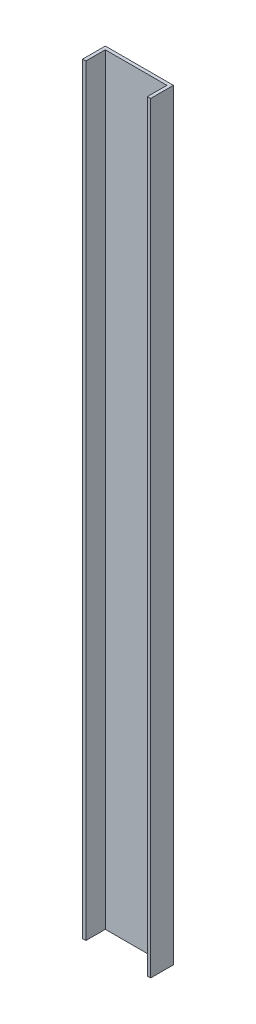
ISO-10303-21;
HEADER;
FILE_DESCRIPTION(('STEP AP214'),'2;1');
FILE_NAME('part.step','',(''),(''),'','','');
FILE_SCHEMA(('AUTOMOTIVE_DESIGN { 1 0 10303 214 1 1 1 1 }'));
ENDSEC;
DATA;
#1=APPLICATION_CONTEXT('core data for automotive mechanical design processes');
#2=APPLICATION_PROTOCOL_DEFINITION('international standard','automotive_design',2000,#1);
#3=PRODUCT_CONTEXT('',#1,'mechanical');
#4=PRODUCT('Part','Part','',(#3));
#5=PRODUCT_RELATED_PRODUCT_CATEGORY('part','',(#4));
#6=PRODUCT_DEFINITION_FORMATION('','',#4);
#7=PRODUCT_DEFINITION_CONTEXT('part definition',#1,'design');
#8=PRODUCT_DEFINITION('design','',#6,#7);
#9=PRODUCT_DEFINITION_SHAPE('','',#8);
#10=(LENGTH_UNIT() NAMED_UNIT(*) SI_UNIT(.MILLI.,.METRE.));
#11=(NAMED_UNIT(*) PLANE_ANGLE_UNIT() SI_UNIT($,.RADIAN.));
#12=(NAMED_UNIT(*) SI_UNIT($,.STERADIAN.) SOLID_ANGLE_UNIT());
#13=UNCERTAINTY_MEASURE_WITH_UNIT(LENGTH_MEASURE(1.E-05),#10,'distance_accuracy_value','');
#14=(GEOMETRIC_REPRESENTATION_CONTEXT(3) GLOBAL_UNCERTAINTY_ASSIGNED_CONTEXT((#13)) GLOBAL_UNIT_ASSIGNED_CONTEXT((#10,
#11,#12)) REPRESENTATION_CONTEXT('',''));
#15=CARTESIAN_POINT('',(0.,0.,0.));
#16=DIRECTION('',(0.,0.,1.));
#17=DIRECTION('',(1.,0.,0.));
#18=AXIS2_PLACEMENT_3D('',#15,#16,#17);
#19=CARTESIAN_POINT('',(200.,0.,-70.));
#20=DIRECTION('',(0.,0.,-1.));
#21=DIRECTION('',(-1.,0.,0.));
#22=AXIS2_PLACEMENT_3D('',#19,#20,#21);
#23=PLANE('',#22);
#24=DIRECTION('',(-1.,0.,0.));
#25=VECTOR('',#24,1.);
#26=CARTESIAN_POINT('',(200.,2350.,-70.));
#27=LINE('',#26,#25);
#28=CARTESIAN_POINT('',(200.,2350.,-70.));
#29=VERTEX_POINT('',#28);
#30=CARTESIAN_POINT('',(-10.,2350.,-70.));
#31=VERTEX_POINT('',#30);
#32=EDGE_CURVE('E130',#29,#31,#27,.T.);
#33=ORIENTED_EDGE('',*,*,#32,.F.);
#34=DIRECTION('',(0.,1.,0.));
#35=VECTOR('',#34,1.);
#36=CARTESIAN_POINT('',(200.,0.,-70.));
#37=LINE('',#36,#35);
#38=CARTESIAN_POINT('',(200.,0.,-70.));
#39=VERTEX_POINT('',#38);
#40=EDGE_CURVE('E11',#39,#29,#37,.T.);
#41=ORIENTED_EDGE('',*,*,#40,.F.);
#42=DIRECTION('',(-1.,0.,0.));
#43=VECTOR('',#42,1.);
#44=CARTESIAN_POINT('',(200.,0.,-70.));
#45=LINE('',#44,#43);
#46=CARTESIAN_POINT('',(-10.,0.,-70.));
#47=VERTEX_POINT('',#46);
#48=EDGE_CURVE('E150',#39,#47,#45,.T.);
#49=ORIENTED_EDGE('',*,*,#48,.T.);
#50=DIRECTION('',(0.,1.,0.));
#51=VECTOR('',#50,1.);
#52=CARTESIAN_POINT('',(-10.,0.,-70.));
#53=LINE('',#52,#51);
#54=EDGE_CURVE('E36',#47,#31,#53,.T.);
#55=ORIENTED_EDGE('',*,*,#54,.T.);
#56=EDGE_LOOP('',(#33,#41,#49,#55));
#57=FACE_BOUND('',#56,.T.);
#58=ADVANCED_FACE('F33',(#57),#23,.T.);
#59=CARTESIAN_POINT('',(200.,0.,0.));
#60=DIRECTION('',(1.,0.,0.));
#61=DIRECTION('',(0.,0.,-1.));
#62=AXIS2_PLACEMENT_3D('',#59,#60,#61);
#63=PLANE('',#62);
#64=DIRECTION('',(0.,0.,-1.));
#65=VECTOR('',#64,1.);
#66=CARTESIAN_POINT('',(200.,2350.,0.));
#67=LINE('',#66,#65);
#68=CARTESIAN_POINT('',(200.,2350.,0.));
#69=VERTEX_POINT('',#68);
#70=EDGE_CURVE('E148',#69,#29,#67,.T.);
#71=ORIENTED_EDGE('',*,*,#70,.F.);
#72=DIRECTION('',(0.,1.,0.));
#73=VECTOR('',#72,1.);
#74=CARTESIAN_POINT('',(200.,0.,0.));
#75=LINE('',#74,#73);
#76=CARTESIAN_POINT('',(200.,0.,0.));
#77=VERTEX_POINT('',#76);
#78=EDGE_CURVE('E42',#77,#69,#75,.T.);
#79=ORIENTED_EDGE('',*,*,#78,.F.);
#80=DIRECTION('',(0.,0.,-1.));
#81=VECTOR('',#80,1.);
#82=CARTESIAN_POINT('',(200.,0.,0.));
#83=LINE('',#82,#81);
#84=EDGE_CURVE('E120',#77,#39,#83,.T.);
#85=ORIENTED_EDGE('',*,*,#84,.T.);
#86=ORIENTED_EDGE('',*,*,#40,.T.);
#87=EDGE_LOOP('',(#71,#79,#85,#86));
#88=FACE_BOUND('',#87,.T.);
#89=ADVANCED_FACE('F162',(#88),#63,.T.);
#90=CARTESIAN_POINT('',(190.,0.,0.));
#91=DIRECTION('',(0.,0.,1.));
#92=DIRECTION('',(1.,0.,0.));
#93=AXIS2_PLACEMENT_3D('',#90,#91,#92);
#94=PLANE('',#93);
#95=DIRECTION('',(1.,0.,0.));
#96=VECTOR('',#95,1.);
#97=CARTESIAN_POINT('',(190.,2350.,0.));
#98=LINE('',#97,#96);
#99=CARTESIAN_POINT('',(190.,2350.,0.));
#100=VERTEX_POINT('',#99);
#101=EDGE_CURVE('E107',#100,#69,#98,.T.);
#102=ORIENTED_EDGE('',*,*,#101,.F.);
#103=DIRECTION('',(0.,1.,0.));
#104=VECTOR('',#103,1.);
#105=CARTESIAN_POINT('',(190.,0.,0.));
#106=LINE('',#105,#104);
#107=CARTESIAN_POINT('',(190.,0.,0.));
#108=VERTEX_POINT('',#107);
#109=EDGE_CURVE('E102',#108,#100,#106,.T.);
#110=ORIENTED_EDGE('',*,*,#109,.F.);
#111=DIRECTION('',(1.,0.,0.));
#112=VECTOR('',#111,1.);
#113=CARTESIAN_POINT('',(190.,0.,0.));
#114=LINE('',#113,#112);
#115=EDGE_CURVE('E105',#108,#77,#114,.T.);
#116=ORIENTED_EDGE('',*,*,#115,.T.);
#117=ORIENTED_EDGE('',*,*,#78,.T.);
#118=EDGE_LOOP('',(#102,#110,#116,#117));
#119=FACE_BOUND('',#118,.T.);
#120=ADVANCED_FACE('F104',(#119),#94,.T.);
#121=CARTESIAN_POINT('',(190.,0.,-60.));
#122=DIRECTION('',(-1.,0.,0.));
#123=DIRECTION('',(0.,0.,1.));
#124=AXIS2_PLACEMENT_3D('',#121,#122,#123);
#125=PLANE('',#124);
#126=DIRECTION('',(0.,0.,1.));
#127=VECTOR('',#126,1.);
#128=CARTESIAN_POINT('',(190.,2350.,-60.));
#129=LINE('',#128,#127);
#130=CARTESIAN_POINT('',(190.,2350.,-60.));
#131=VERTEX_POINT('',#130);
#132=EDGE_CURVE('E145',#131,#100,#129,.T.);
#133=ORIENTED_EDGE('',*,*,#132,.F.);
#134=DIRECTION('',(0.,1.,0.));
#135=VECTOR('',#134,1.);
#136=CARTESIAN_POINT('',(190.,0.,-60.));
#137=LINE('',#136,#135);
#138=CARTESIAN_POINT('',(190.,0.,-60.));
#139=VERTEX_POINT('',#138);
#140=EDGE_CURVE('E112',#139,#131,#137,.T.);
#141=ORIENTED_EDGE('',*,*,#140,.F.);
#142=DIRECTION('',(0.,0.,1.));
#143=VECTOR('',#142,1.);
#144=CARTESIAN_POINT('',(190.,0.,-60.));
#145=LINE('',#144,#143);
#146=EDGE_CURVE('E118',#139,#108,#145,.T.);
#147=ORIENTED_EDGE('',*,*,#146,.T.);
#148=ORIENTED_EDGE('',*,*,#109,.T.);
#149=EDGE_LOOP('',(#133,#141,#147,#148));
#150=FACE_BOUND('',#149,.T.);
#151=ADVANCED_FACE('F122',(#150),#125,.T.);
#152=CARTESIAN_POINT('',(0.,0.,-60.));
#153=DIRECTION('',(0.,0.,1.));
#154=DIRECTION('',(1.,0.,0.));
#155=AXIS2_PLACEMENT_3D('',#152,#153,#154);
#156=PLANE('',#155);
#157=DIRECTION('',(1.,0.,0.));
#158=VECTOR('',#157,1.);
#159=CARTESIAN_POINT('',(0.,2350.,-60.));
#160=LINE('',#159,#158);
#161=CARTESIAN_POINT('',(0.,2350.,-60.));
#162=VERTEX_POINT('',#161);
#163=EDGE_CURVE('E142',#162,#131,#160,.T.);
#164=ORIENTED_EDGE('',*,*,#163,.F.);
#165=DIRECTION('',(0.,1.,0.));
#166=VECTOR('',#165,1.);
#167=CARTESIAN_POINT('',(0.,0.,-60.));
#168=LINE('',#167,#166);
#169=CARTESIAN_POINT('',(0.,0.,-60.));
#170=VERTEX_POINT('',#169);
#171=EDGE_CURVE('E154',#170,#162,#168,.T.);
#172=ORIENTED_EDGE('',*,*,#171,.F.);
#173=DIRECTION('',(1.,0.,0.));
#174=VECTOR('',#173,1.);
#175=CARTESIAN_POINT('',(0.,0.,-60.));
#176=LINE('',#175,#174);
#177=EDGE_CURVE('E123',#170,#139,#176,.T.);
#178=ORIENTED_EDGE('',*,*,#177,.T.);
#179=ORIENTED_EDGE('',*,*,#140,.T.);
#180=EDGE_LOOP('',(#164,#172,#178,#179));
#181=FACE_BOUND('',#180,.T.);
#182=ADVANCED_FACE('F175',(#181),#156,.T.);
#183=CARTESIAN_POINT('',(0.,0.,0.));
#184=DIRECTION('',(1.,0.,0.));
#185=DIRECTION('',(0.,0.,-1.));
#186=AXIS2_PLACEMENT_3D('',#183,#184,#185);
#187=PLANE('',#186);
#188=DIRECTION('',(0.,0.,-1.));
#189=VECTOR('',#188,1.);
#190=CARTESIAN_POINT('',(0.,2350.,0.));
#191=LINE('',#190,#189);
#192=CARTESIAN_POINT('',(0.,2350.,0.));
#193=VERTEX_POINT('',#192);
#194=EDGE_CURVE('E139',#193,#162,#191,.T.);
#195=ORIENTED_EDGE('',*,*,#194,.F.);
#196=DIRECTION('',(0.,1.,0.));
#197=VECTOR('',#196,1.);
#198=CARTESIAN_POINT('',(0.,0.,0.));
#199=LINE('',#198,#197);
#200=CARTESIAN_POINT('',(0.,0.,0.));
#201=VERTEX_POINT('',#200);
#202=EDGE_CURVE('E156',#201,#193,#199,.T.);
#203=ORIENTED_EDGE('',*,*,#202,.F.);
#204=DIRECTION('',(0.,0.,-1.));
#205=VECTOR('',#204,1.);
#206=CARTESIAN_POINT('',(0.,0.,0.));
#207=LINE('',#206,#205);
#208=EDGE_CURVE('E125',#201,#170,#207,.T.);
#209=ORIENTED_EDGE('',*,*,#208,.T.);
#210=ORIENTED_EDGE('',*,*,#171,.T.);
#211=EDGE_LOOP('',(#195,#203,#209,#210));
#212=FACE_BOUND('',#211,.T.);
#213=ADVANCED_FACE('F178',(#212),#187,.T.);
#214=CARTESIAN_POINT('',(-10.,0.,0.));
#215=DIRECTION('',(0.,0.,1.));
#216=DIRECTION('',(1.,0.,0.));
#217=AXIS2_PLACEMENT_3D('',#214,#215,#216);
#218=PLANE('',#217);
#219=DIRECTION('',(1.,0.,0.));
#220=VECTOR('',#219,1.);
#221=CARTESIAN_POINT('',(-10.,2350.,0.));
#222=LINE('',#221,#220);
#223=CARTESIAN_POINT('',(-10.,2350.,0.));
#224=VERTEX_POINT('',#223);
#225=EDGE_CURVE('E136',#224,#193,#222,.T.);
#226=ORIENTED_EDGE('',*,*,#225,.F.);
#227=DIRECTION('',(0.,1.,0.));
#228=VECTOR('',#227,1.);
#229=CARTESIAN_POINT('',(-10.,0.,0.));
#230=LINE('',#229,#228);
#231=CARTESIAN_POINT('',(-10.,0.,0.));
#232=VERTEX_POINT('',#231);
#233=EDGE_CURVE('E157',#232,#224,#230,.T.);
#234=ORIENTED_EDGE('',*,*,#233,.F.);
#235=DIRECTION('',(1.,0.,0.));
#236=VECTOR('',#235,1.);
#237=CARTESIAN_POINT('',(-10.,0.,0.));
#238=LINE('',#237,#236);
#239=EDGE_CURVE('E253',#232,#201,#238,.T.);
#240=ORIENTED_EDGE('',*,*,#239,.T.);
#241=ORIENTED_EDGE('',*,*,#202,.T.);
#242=EDGE_LOOP('',(#226,#234,#240,#241));
#243=FACE_BOUND('',#242,.T.);
#244=ADVANCED_FACE('F182',(#243),#218,.T.);
#245=CARTESIAN_POINT('',(-10.,0.,-70.));
#246=DIRECTION('',(-1.,0.,0.));
#247=DIRECTION('',(0.,0.,1.));
#248=AXIS2_PLACEMENT_3D('',#245,#246,#247);
#249=PLANE('',#248);
#250=DIRECTION('',(0.,0.,1.));
#251=VECTOR('',#250,1.);
#252=CARTESIAN_POINT('',(-10.,2350.,-70.));
#253=LINE('',#252,#251);
#254=EDGE_CURVE('E133',#31,#224,#253,.T.);
#255=ORIENTED_EDGE('',*,*,#254,.F.);
#256=ORIENTED_EDGE('',*,*,#54,.F.);
#257=DIRECTION('',(0.,0.,1.));
#258=VECTOR('',#257,1.);
#259=CARTESIAN_POINT('',(-10.,0.,-70.));
#260=LINE('',#259,#258);
#261=EDGE_CURVE('E254',#47,#232,#260,.T.);
#262=ORIENTED_EDGE('',*,*,#261,.T.);
#263=ORIENTED_EDGE('',*,*,#233,.T.);
#264=EDGE_LOOP('',(#255,#256,#262,#263));
#265=FACE_BOUND('',#264,.T.);
#266=ADVANCED_FACE('F159',(#265),#249,.T.);
#267=CARTESIAN_POINT('',(0.,0.,0.));
#268=DIRECTION('',(0.,1.,0.));
#269=DIRECTION('',(0.,0.,1.));
#270=AXIS2_PLACEMENT_3D('',#267,#268,#269);
#271=PLANE('',#270);
#272=ORIENTED_EDGE('',*,*,#48,.F.);
#273=ORIENTED_EDGE('',*,*,#84,.F.);
#274=ORIENTED_EDGE('',*,*,#115,.F.);
#275=ORIENTED_EDGE('',*,*,#146,.F.);
#276=ORIENTED_EDGE('',*,*,#177,.F.);
#277=ORIENTED_EDGE('',*,*,#208,.F.);
#278=ORIENTED_EDGE('',*,*,#239,.F.);
#279=ORIENTED_EDGE('',*,*,#261,.F.);
#280=EDGE_LOOP('',(#272,#273,#274,#275,#276,#277,#278,#279));
#281=FACE_BOUND('',#280,.T.);
#282=ADVANCED_FACE('F116',(#281),#271,.F.);
#283=CARTESIAN_POINT('',(0.,2350.,0.));
#284=DIRECTION('',(0.,1.,0.));
#285=DIRECTION('',(0.,0.,1.));
#286=AXIS2_PLACEMENT_3D('',#283,#284,#285);
#287=PLANE('',#286);
#288=ORIENTED_EDGE('',*,*,#32,.T.);
#289=ORIENTED_EDGE('',*,*,#254,.T.);
#290=ORIENTED_EDGE('',*,*,#225,.T.);
#291=ORIENTED_EDGE('',*,*,#194,.T.);
#292=ORIENTED_EDGE('',*,*,#163,.T.);
#293=ORIENTED_EDGE('',*,*,#132,.T.);
#294=ORIENTED_EDGE('',*,*,#101,.T.);
#295=ORIENTED_EDGE('',*,*,#70,.T.);
#296=EDGE_LOOP('',(#288,#289,#290,#291,#292,#293,#294,#295));
#297=FACE_BOUND('',#296,.T.);
#298=ADVANCED_FACE('F161',(#297),#287,.T.);
#299=CLOSED_SHELL('',(#58,#89,#120,#151,#182,#213,#244,#266,#282,#298));
#300=MANIFOLD_SOLID_BREP('B2',#299);
#301=ADVANCED_BREP_SHAPE_REPRESENTATION('',(#18,#300),#14);
#302=SHAPE_DEFINITION_REPRESENTATION(#9,#301);
ENDSEC;
END-ISO-10303-21;
